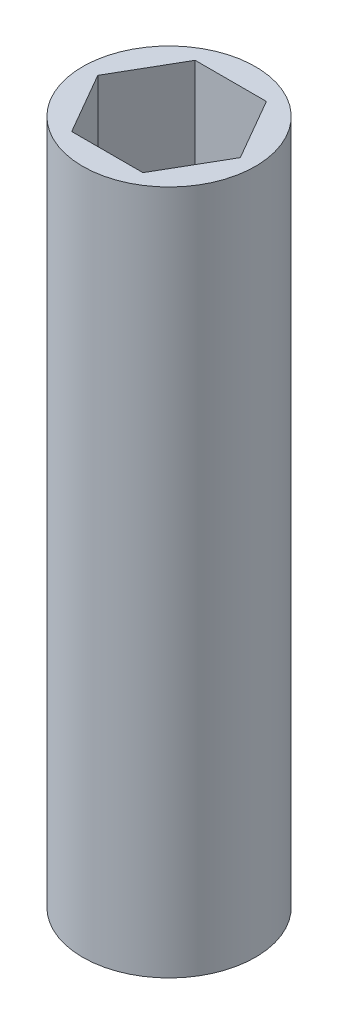
ISO-10303-21;
HEADER;
FILE_DESCRIPTION(('STEP AP214'),'2;1');
FILE_NAME('part.step','',(''),(''),'','','');
FILE_SCHEMA(('AUTOMOTIVE_DESIGN { 1 0 10303 214 1 1 1 1 }'));
ENDSEC;
DATA;
#1=APPLICATION_CONTEXT('core data for automotive mechanical design processes');
#2=APPLICATION_PROTOCOL_DEFINITION('international standard','automotive_design',2000,#1);
#3=PRODUCT_CONTEXT('',#1,'mechanical');
#4=PRODUCT('Part','Part','',(#3));
#5=PRODUCT_RELATED_PRODUCT_CATEGORY('part','',(#4));
#6=PRODUCT_DEFINITION_FORMATION('','',#4);
#7=PRODUCT_DEFINITION_CONTEXT('part definition',#1,'design');
#8=PRODUCT_DEFINITION('design','',#6,#7);
#9=PRODUCT_DEFINITION_SHAPE('','',#8);
#10=(LENGTH_UNIT() NAMED_UNIT(*) SI_UNIT(.MILLI.,.METRE.));
#11=(NAMED_UNIT(*) PLANE_ANGLE_UNIT() SI_UNIT($,.RADIAN.));
#12=(NAMED_UNIT(*) SI_UNIT($,.STERADIAN.) SOLID_ANGLE_UNIT());
#13=UNCERTAINTY_MEASURE_WITH_UNIT(LENGTH_MEASURE(1.E-05),#10,'distance_accuracy_value','');
#14=(GEOMETRIC_REPRESENTATION_CONTEXT(3) GLOBAL_UNCERTAINTY_ASSIGNED_CONTEXT((#13)) GLOBAL_UNIT_ASSIGNED_CONTEXT((#10,
#11,#12)) REPRESENTATION_CONTEXT('',''));
#15=CARTESIAN_POINT('',(0.,0.,0.));
#16=DIRECTION('',(0.,0.,1.));
#17=DIRECTION('',(1.,0.,0.));
#18=AXIS2_PLACEMENT_3D('',#15,#16,#17);
#19=CARTESIAN_POINT('',(0.,56.388,0.));
#20=DIRECTION('',(0.,1.,0.));
#21=DIRECTION('',(0.,0.,1.));
#22=AXIS2_PLACEMENT_3D('',#19,#20,#21);
#23=PLANE('',#22);
#24=CARTESIAN_POINT('',(0.,56.388,0.));
#25=DIRECTION('',(0.,1.,0.));
#26=DIRECTION('',(0.,0.,1.));
#27=AXIS2_PLACEMENT_3D('',#24,#25,#26);
#28=CIRCLE('',#27,7.112);
#29=CARTESIAN_POINT('',(0.,56.388,7.112));
#30=VERTEX_POINT('',#29);
#31=EDGE_CURVE('E11',#30,#30,#28,.T.);
#32=ORIENTED_EDGE('',*,*,#31,.T.);
#33=EDGE_LOOP('',(#32));
#34=FACE_BOUND('',#33,.T.);
#35=DIRECTION('',(0.5,0.,-0.866025403784439));
#36=VECTOR('',#35,1.);
#37=CARTESIAN_POINT('',(2.9329393674833,56.388,5.08));
#38=LINE('',#37,#36);
#39=CARTESIAN_POINT('',(2.9329393674833,56.388,5.08));
#40=VERTEX_POINT('',#39);
#41=CARTESIAN_POINT('',(5.8658787349666,56.388,0.));
#42=VERTEX_POINT('',#41);
#43=EDGE_CURVE('E104',#40,#42,#38,.T.);
#44=ORIENTED_EDGE('',*,*,#43,.F.);
#45=DIRECTION('',(1.,0.,0.));
#46=VECTOR('',#45,1.);
#47=CARTESIAN_POINT('',(-2.9329393674833,56.388,5.08));
#48=LINE('',#47,#46);
#49=CARTESIAN_POINT('',(-2.9329393674833,56.388,5.08));
#50=VERTEX_POINT('',#49);
#51=EDGE_CURVE('E96',#50,#40,#48,.T.);
#52=ORIENTED_EDGE('',*,*,#51,.F.);
#53=DIRECTION('',(0.5,0.,0.866025403784439));
#54=VECTOR('',#53,1.);
#55=CARTESIAN_POINT('',(-5.8658787349666,56.388,0.));
#56=LINE('',#55,#54);
#57=CARTESIAN_POINT('',(-5.8658787349666,56.388,0.));
#58=VERTEX_POINT('',#57);
#59=EDGE_CURVE('E124',#58,#50,#56,.T.);
#60=ORIENTED_EDGE('',*,*,#59,.F.);
#61=DIRECTION('',(-0.5,0.,0.866025403784439));
#62=VECTOR('',#61,1.);
#63=CARTESIAN_POINT('',(-2.9329393674833,56.388,-5.08));
#64=LINE('',#63,#62);
#65=CARTESIAN_POINT('',(-2.9329393674833,56.388,-5.08));
#66=VERTEX_POINT('',#65);
#67=EDGE_CURVE('E122',#66,#58,#64,.T.);
#68=ORIENTED_EDGE('',*,*,#67,.F.);
#69=DIRECTION('',(-1.,0.,0.));
#70=VECTOR('',#69,1.);
#71=CARTESIAN_POINT('',(2.9329393674833,56.388,-5.08));
#72=LINE('',#71,#70);
#73=CARTESIAN_POINT('',(2.9329393674833,56.388,-5.08));
#74=VERTEX_POINT('',#73);
#75=EDGE_CURVE('E118',#74,#66,#72,.T.);
#76=ORIENTED_EDGE('',*,*,#75,.F.);
#77=DIRECTION('',(-0.5,0.,-0.866025403784439));
#78=VECTOR('',#77,1.);
#79=CARTESIAN_POINT('',(5.8658787349666,56.388,0.));
#80=LINE('',#79,#78);
#81=EDGE_CURVE('E116',#42,#74,#80,.T.);
#82=ORIENTED_EDGE('',*,*,#81,.F.);
#83=EDGE_LOOP('',(#44,#52,#60,#68,#76,#82));
#84=FACE_BOUND('',#83,.T.);
#85=ADVANCED_FACE('F43',(#34,#84),#23,.T.);
#86=CARTESIAN_POINT('',(0.,0.,0.));
#87=DIRECTION('',(0.,1.,0.));
#88=DIRECTION('',(0.,0.,1.));
#89=AXIS2_PLACEMENT_3D('',#86,#87,#88);
#90=PLANE('',#89);
#91=CARTESIAN_POINT('',(0.,0.,0.));
#92=DIRECTION('',(0.,1.,0.));
#93=DIRECTION('',(0.,0.,1.));
#94=AXIS2_PLACEMENT_3D('',#91,#92,#93);
#95=CIRCLE('',#94,7.112);
#96=CARTESIAN_POINT('',(0.,0.,7.112));
#97=VERTEX_POINT('',#96);
#98=EDGE_CURVE('E47',#97,#97,#95,.T.);
#99=ORIENTED_EDGE('',*,*,#98,.F.);
#100=EDGE_LOOP('',(#99));
#101=FACE_BOUND('',#100,.T.);
#102=DIRECTION('',(1.,0.,0.));
#103=VECTOR('',#102,1.);
#104=CARTESIAN_POINT('',(-2.9329393674833,0.,5.08));
#105=LINE('',#104,#103);
#106=CARTESIAN_POINT('',(-2.9329393674833,0.,5.08));
#107=VERTEX_POINT('',#106);
#108=CARTESIAN_POINT('',(2.9329393674833,0.,5.08));
#109=VERTEX_POINT('',#108);
#110=EDGE_CURVE('E66',#107,#109,#105,.T.);
#111=ORIENTED_EDGE('',*,*,#110,.T.);
#112=DIRECTION('',(0.5,0.,-0.866025403784439));
#113=VECTOR('',#112,1.);
#114=CARTESIAN_POINT('',(2.9329393674833,0.,5.08));
#115=LINE('',#114,#113);
#116=CARTESIAN_POINT('',(5.8658787349666,0.,0.));
#117=VERTEX_POINT('',#116);
#118=EDGE_CURVE('E111',#109,#117,#115,.T.);
#119=ORIENTED_EDGE('',*,*,#118,.T.);
#120=DIRECTION('',(-0.5,0.,-0.866025403784439));
#121=VECTOR('',#120,1.);
#122=CARTESIAN_POINT('',(5.8658787349666,0.,0.));
#123=LINE('',#122,#121);
#124=CARTESIAN_POINT('',(2.9329393674833,0.,-5.08));
#125=VERTEX_POINT('',#124);
#126=EDGE_CURVE('E128',#117,#125,#123,.T.);
#127=ORIENTED_EDGE('',*,*,#126,.T.);
#128=DIRECTION('',(-1.,0.,0.));
#129=VECTOR('',#128,1.);
#130=CARTESIAN_POINT('',(2.9329393674833,0.,-5.08));
#131=LINE('',#130,#129);
#132=CARTESIAN_POINT('',(-2.9329393674833,0.,-5.08));
#133=VERTEX_POINT('',#132);
#134=EDGE_CURVE('E131',#125,#133,#131,.T.);
#135=ORIENTED_EDGE('',*,*,#134,.T.);
#136=DIRECTION('',(-0.5,0.,0.866025403784439));
#137=VECTOR('',#136,1.);
#138=CARTESIAN_POINT('',(-2.9329393674833,0.,-5.08));
#139=LINE('',#138,#137);
#140=CARTESIAN_POINT('',(-5.8658787349666,0.,0.));
#141=VERTEX_POINT('',#140);
#142=EDGE_CURVE('E134',#133,#141,#139,.T.);
#143=ORIENTED_EDGE('',*,*,#142,.T.);
#144=DIRECTION('',(0.5,0.,0.866025403784439));
#145=VECTOR('',#144,1.);
#146=CARTESIAN_POINT('',(-5.8658787349666,0.,0.));
#147=LINE('',#146,#145);
#148=EDGE_CURVE('E105',#141,#107,#147,.T.);
#149=ORIENTED_EDGE('',*,*,#148,.T.);
#150=EDGE_LOOP('',(#111,#119,#127,#135,#143,#149));
#151=FACE_BOUND('',#150,.T.);
#152=ADVANCED_FACE('F151',(#101,#151),#90,.F.);
#153=CARTESIAN_POINT('',(0.,56.388,0.));
#154=DIRECTION('',(0.,-1.,0.));
#155=DIRECTION('',(0.,0.,-1.));
#156=AXIS2_PLACEMENT_3D('',#153,#154,#155);
#157=CYLINDRICAL_SURFACE('',#156,7.112);
#158=ORIENTED_EDGE('',*,*,#31,.F.);
#159=EDGE_LOOP('',(#158));
#160=FACE_BOUND('',#159,.T.);
#161=ORIENTED_EDGE('',*,*,#98,.T.);
#162=EDGE_LOOP('',(#161));
#163=FACE_BOUND('',#162,.T.);
#164=ADVANCED_FACE('F45',(#160,#163),#157,.T.);
#165=CARTESIAN_POINT('',(-2.9329393674833,56.388,5.08));
#166=DIRECTION('',(0.,0.,-1.));
#167=DIRECTION('',(-1.,0.,0.));
#168=AXIS2_PLACEMENT_3D('',#165,#166,#167);
#169=PLANE('',#168);
#170=ORIENTED_EDGE('',*,*,#110,.F.);
#171=DIRECTION('',(0.,-1.,0.));
#172=VECTOR('',#171,1.);
#173=CARTESIAN_POINT('',(-2.9329393674833,56.388,5.08));
#174=LINE('',#173,#172);
#175=EDGE_CURVE('E100',#50,#107,#174,.T.);
#176=ORIENTED_EDGE('',*,*,#175,.F.);
#177=ORIENTED_EDGE('',*,*,#51,.T.);
#178=DIRECTION('',(0.,-1.,0.));
#179=VECTOR('',#178,1.);
#180=CARTESIAN_POINT('',(2.9329393674833,56.388,5.08));
#181=LINE('',#180,#179);
#182=EDGE_CURVE('E99',#40,#109,#181,.T.);
#183=ORIENTED_EDGE('',*,*,#182,.T.);
#184=EDGE_LOOP('',(#170,#176,#177,#183));
#185=FACE_BOUND('',#184,.T.);
#186=ADVANCED_FACE('F98',(#185),#169,.T.);
#187=CARTESIAN_POINT('',(2.9329393674833,56.388,5.08));
#188=DIRECTION('',(-0.866025403784439,0.,-0.5));
#189=DIRECTION('',(-0.5,0.,0.866025403784439));
#190=AXIS2_PLACEMENT_3D('',#187,#188,#189);
#191=PLANE('',#190);
#192=ORIENTED_EDGE('',*,*,#118,.F.);
#193=ORIENTED_EDGE('',*,*,#182,.F.);
#194=ORIENTED_EDGE('',*,*,#43,.T.);
#195=DIRECTION('',(0.,-1.,0.));
#196=VECTOR('',#195,1.);
#197=CARTESIAN_POINT('',(5.8658787349666,56.388,0.));
#198=LINE('',#197,#196);
#199=EDGE_CURVE('E112',#42,#117,#198,.T.);
#200=ORIENTED_EDGE('',*,*,#199,.T.);
#201=EDGE_LOOP('',(#192,#193,#194,#200));
#202=FACE_BOUND('',#201,.T.);
#203=ADVANCED_FACE('F108',(#202),#191,.T.);
#204=CARTESIAN_POINT('',(5.8658787349666,56.388,0.));
#205=DIRECTION('',(-0.866025403784439,0.,0.5));
#206=DIRECTION('',(0.5,0.,0.866025403784439));
#207=AXIS2_PLACEMENT_3D('',#204,#205,#206);
#208=PLANE('',#207);
#209=ORIENTED_EDGE('',*,*,#126,.F.);
#210=ORIENTED_EDGE('',*,*,#199,.F.);
#211=ORIENTED_EDGE('',*,*,#81,.T.);
#212=DIRECTION('',(0.,-1.,0.));
#213=VECTOR('',#212,1.);
#214=CARTESIAN_POINT('',(2.9329393674833,56.388,-5.08));
#215=LINE('',#214,#213);
#216=EDGE_CURVE('E143',#74,#125,#215,.T.);
#217=ORIENTED_EDGE('',*,*,#216,.T.);
#218=EDGE_LOOP('',(#209,#210,#211,#217));
#219=FACE_BOUND('',#218,.T.);
#220=ADVANCED_FACE('F147',(#219),#208,.T.);
#221=CARTESIAN_POINT('',(2.9329393674833,56.388,-5.08));
#222=DIRECTION('',(0.,0.,1.));
#223=DIRECTION('',(1.,0.,0.));
#224=AXIS2_PLACEMENT_3D('',#221,#222,#223);
#225=PLANE('',#224);
#226=ORIENTED_EDGE('',*,*,#134,.F.);
#227=ORIENTED_EDGE('',*,*,#216,.F.);
#228=ORIENTED_EDGE('',*,*,#75,.T.);
#229=DIRECTION('',(0.,-1.,0.));
#230=VECTOR('',#229,1.);
#231=CARTESIAN_POINT('',(-2.9329393674833,56.388,-5.08));
#232=LINE('',#231,#230);
#233=EDGE_CURVE('E141',#66,#133,#232,.T.);
#234=ORIENTED_EDGE('',*,*,#233,.T.);
#235=EDGE_LOOP('',(#226,#227,#228,#234));
#236=FACE_BOUND('',#235,.T.);
#237=ADVANCED_FACE('F159',(#236),#225,.T.);
#238=CARTESIAN_POINT('',(-2.9329393674833,56.388,-5.08));
#239=DIRECTION('',(0.866025403784439,0.,0.5));
#240=DIRECTION('',(0.5,0.,-0.866025403784439));
#241=AXIS2_PLACEMENT_3D('',#238,#239,#240);
#242=PLANE('',#241);
#243=ORIENTED_EDGE('',*,*,#142,.F.);
#244=ORIENTED_EDGE('',*,*,#233,.F.);
#245=ORIENTED_EDGE('',*,*,#67,.T.);
#246=DIRECTION('',(0.,-1.,0.));
#247=VECTOR('',#246,1.);
#248=CARTESIAN_POINT('',(-5.8658787349666,56.388,0.));
#249=LINE('',#248,#247);
#250=EDGE_CURVE('E58',#58,#141,#249,.T.);
#251=ORIENTED_EDGE('',*,*,#250,.T.);
#252=EDGE_LOOP('',(#243,#244,#245,#251));
#253=FACE_BOUND('',#252,.T.);
#254=ADVANCED_FACE('F157',(#253),#242,.T.);
#255=CARTESIAN_POINT('',(-5.8658787349666,56.388,0.));
#256=DIRECTION('',(0.866025403784439,0.,-0.5));
#257=DIRECTION('',(-0.5,0.,-0.866025403784439));
#258=AXIS2_PLACEMENT_3D('',#255,#256,#257);
#259=PLANE('',#258);
#260=ORIENTED_EDGE('',*,*,#148,.F.);
#261=ORIENTED_EDGE('',*,*,#250,.F.);
#262=ORIENTED_EDGE('',*,*,#59,.T.);
#263=ORIENTED_EDGE('',*,*,#175,.T.);
#264=EDGE_LOOP('',(#260,#261,#262,#263));
#265=FACE_BOUND('',#264,.T.);
#266=ADVANCED_FACE('F153',(#265),#259,.T.);
#267=CLOSED_SHELL('',(#85,#152,#164,#186,#203,#220,#237,#254,#266));
#268=MANIFOLD_SOLID_BREP('B2',#267);
#269=ADVANCED_BREP_SHAPE_REPRESENTATION('',(#18,#268),#14);
#270=SHAPE_DEFINITION_REPRESENTATION(#9,#269);
ENDSEC;
END-ISO-10303-21;
